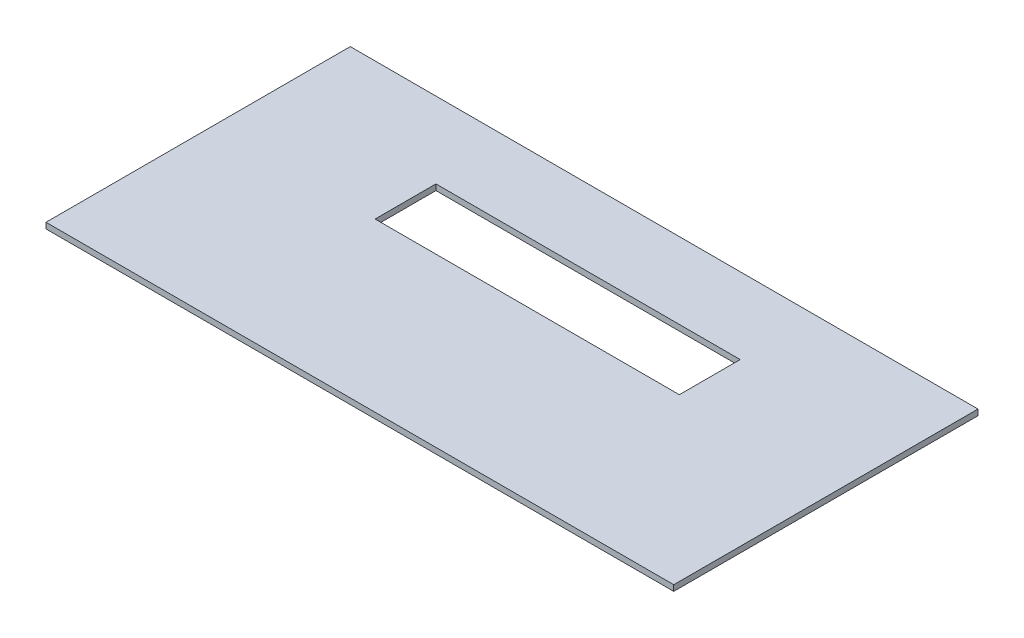
ISO-10303-21;
HEADER;
FILE_DESCRIPTION(('STEP AP214'),'2;1');
FILE_NAME('part.step','',(''),(''),'','','');
FILE_SCHEMA(('AUTOMOTIVE_DESIGN { 1 0 10303 214 1 1 1 1 }'));
ENDSEC;
DATA;
#1=APPLICATION_CONTEXT('core data for automotive mechanical design processes');
#2=APPLICATION_PROTOCOL_DEFINITION('international standard','automotive_design',2000,#1);
#3=PRODUCT_CONTEXT('',#1,'mechanical');
#4=PRODUCT('Part','Part','',(#3));
#5=PRODUCT_RELATED_PRODUCT_CATEGORY('part','',(#4));
#6=PRODUCT_DEFINITION_FORMATION('','',#4);
#7=PRODUCT_DEFINITION_CONTEXT('part definition',#1,'design');
#8=PRODUCT_DEFINITION('design','',#6,#7);
#9=PRODUCT_DEFINITION_SHAPE('','',#8);
#10=(LENGTH_UNIT() NAMED_UNIT(*) SI_UNIT(.MILLI.,.METRE.));
#11=(NAMED_UNIT(*) PLANE_ANGLE_UNIT() SI_UNIT($,.RADIAN.));
#12=(NAMED_UNIT(*) SI_UNIT($,.STERADIAN.) SOLID_ANGLE_UNIT());
#13=UNCERTAINTY_MEASURE_WITH_UNIT(LENGTH_MEASURE(1.E-05),#10,'distance_accuracy_value','');
#14=(GEOMETRIC_REPRESENTATION_CONTEXT(3) GLOBAL_UNCERTAINTY_ASSIGNED_CONTEXT((#13)) GLOBAL_UNIT_ASSIGNED_CONTEXT((#10,
#11,#12)) REPRESENTATION_CONTEXT('',''));
#15=CARTESIAN_POINT('',(0.,0.,0.));
#16=DIRECTION('',(0.,0.,1.));
#17=DIRECTION('',(1.,0.,0.));
#18=AXIS2_PLACEMENT_3D('',#15,#16,#17);
#19=CARTESIAN_POINT('',(65.50787,1.21412,31.75));
#20=DIRECTION('',(-1.,0.,0.));
#21=DIRECTION('',(0.,0.,1.));
#22=AXIS2_PLACEMENT_3D('',#19,#20,#21);
#23=PLANE('',#22);
#24=DIRECTION('',(0.,0.,-1.));
#25=VECTOR('',#24,1.);
#26=CARTESIAN_POINT('',(65.50787,0.,31.75));
#27=LINE('',#26,#25);
#28=CARTESIAN_POINT('',(65.50787,0.,31.75));
#29=VERTEX_POINT('',#28);
#30=CARTESIAN_POINT('',(65.50787,0.,-31.75));
#31=VERTEX_POINT('',#30);
#32=EDGE_CURVE('E151',#29,#31,#27,.T.);
#33=ORIENTED_EDGE('',*,*,#32,.T.);
#34=DIRECTION('',(0.,-1.,0.));
#35=VECTOR('',#34,1.);
#36=CARTESIAN_POINT('',(65.50787,1.21412,-31.75));
#37=LINE('',#36,#35);
#38=CARTESIAN_POINT('',(65.50787,1.21412,-31.75));
#39=VERTEX_POINT('',#38);
#40=EDGE_CURVE('E11',#39,#31,#37,.T.);
#41=ORIENTED_EDGE('',*,*,#40,.F.);
#42=DIRECTION('',(0.,0.,-1.));
#43=VECTOR('',#42,1.);
#44=CARTESIAN_POINT('',(65.50787,1.21412,31.75));
#45=LINE('',#44,#43);
#46=CARTESIAN_POINT('',(65.50787,1.21412,31.75));
#47=VERTEX_POINT('',#46);
#48=EDGE_CURVE('E157',#47,#39,#45,.T.);
#49=ORIENTED_EDGE('',*,*,#48,.F.);
#50=DIRECTION('',(0.,-1.,0.));
#51=VECTOR('',#50,1.);
#52=CARTESIAN_POINT('',(65.50787,1.21412,31.75));
#53=LINE('',#52,#51);
#54=EDGE_CURVE('E171',#47,#29,#53,.T.);
#55=ORIENTED_EDGE('',*,*,#54,.T.);
#56=EDGE_LOOP('',(#33,#41,#49,#55));
#57=FACE_BOUND('',#56,.T.);
#58=ADVANCED_FACE('F43',(#57),#23,.F.);
#59=CARTESIAN_POINT('',(-65.50787,1.21412,-31.75));
#60=DIRECTION('',(0.,0.,1.));
#61=DIRECTION('',(1.,0.,0.));
#62=AXIS2_PLACEMENT_3D('',#59,#60,#61);
#63=PLANE('',#62);
#64=DIRECTION('',(-1.,0.,0.));
#65=VECTOR('',#64,1.);
#66=CARTESIAN_POINT('',(-65.50787,0.,-31.75));
#67=LINE('',#66,#65);
#68=CARTESIAN_POINT('',(-65.50787,0.,-31.75));
#69=VERTEX_POINT('',#68);
#70=EDGE_CURVE('E175',#31,#69,#67,.T.);
#71=ORIENTED_EDGE('',*,*,#70,.T.);
#72=DIRECTION('',(0.,-1.,0.));
#73=VECTOR('',#72,1.);
#74=CARTESIAN_POINT('',(-65.50787,1.21412,-31.75));
#75=LINE('',#74,#73);
#76=CARTESIAN_POINT('',(-65.50787,1.21412,-31.75));
#77=VERTEX_POINT('',#76);
#78=EDGE_CURVE('E51',#77,#69,#75,.T.);
#79=ORIENTED_EDGE('',*,*,#78,.F.);
#80=DIRECTION('',(-1.,0.,0.));
#81=VECTOR('',#80,1.);
#82=CARTESIAN_POINT('',(-65.50787,1.21412,-31.75));
#83=LINE('',#82,#81);
#84=EDGE_CURVE('E161',#39,#77,#83,.T.);
#85=ORIENTED_EDGE('',*,*,#84,.F.);
#86=ORIENTED_EDGE('',*,*,#40,.T.);
#87=EDGE_LOOP('',(#71,#79,#85,#86));
#88=FACE_BOUND('',#87,.T.);
#89=ADVANCED_FACE('F209',(#88),#63,.F.);
#90=CARTESIAN_POINT('',(-65.50787,1.21412,31.75));
#91=DIRECTION('',(1.,0.,0.));
#92=DIRECTION('',(0.,0.,-1.));
#93=AXIS2_PLACEMENT_3D('',#90,#91,#92);
#94=PLANE('',#93);
#95=DIRECTION('',(0.,0.,1.));
#96=VECTOR('',#95,1.);
#97=CARTESIAN_POINT('',(-65.50787,0.,31.75));
#98=LINE('',#97,#96);
#99=CARTESIAN_POINT('',(-65.50787,0.,31.75));
#100=VERTEX_POINT('',#99);
#101=EDGE_CURVE('E178',#69,#100,#98,.T.);
#102=ORIENTED_EDGE('',*,*,#101,.T.);
#103=DIRECTION('',(0.,-1.,0.));
#104=VECTOR('',#103,1.);
#105=CARTESIAN_POINT('',(-65.50787,1.21412,31.75));
#106=LINE('',#105,#104);
#107=CARTESIAN_POINT('',(-65.50787,1.21412,31.75));
#108=VERTEX_POINT('',#107);
#109=EDGE_CURVE('E186',#108,#100,#106,.T.);
#110=ORIENTED_EDGE('',*,*,#109,.F.);
#111=DIRECTION('',(0.,0.,1.));
#112=VECTOR('',#111,1.);
#113=CARTESIAN_POINT('',(-65.50787,1.21412,31.75));
#114=LINE('',#113,#112);
#115=EDGE_CURVE('E165',#77,#108,#114,.T.);
#116=ORIENTED_EDGE('',*,*,#115,.F.);
#117=ORIENTED_EDGE('',*,*,#78,.T.);
#118=EDGE_LOOP('',(#102,#110,#116,#117));
#119=FACE_BOUND('',#118,.T.);
#120=ADVANCED_FACE('F195',(#119),#94,.F.);
#121=CARTESIAN_POINT('',(-65.50787,1.21412,31.75));
#122=DIRECTION('',(0.,0.,-1.));
#123=DIRECTION('',(-1.,0.,0.));
#124=AXIS2_PLACEMENT_3D('',#121,#122,#123);
#125=PLANE('',#124);
#126=DIRECTION('',(1.,0.,0.));
#127=VECTOR('',#126,1.);
#128=CARTESIAN_POINT('',(-65.50787,0.,31.75));
#129=LINE('',#128,#127);
#130=EDGE_CURVE('E162',#100,#29,#129,.T.);
#131=ORIENTED_EDGE('',*,*,#130,.T.);
#132=ORIENTED_EDGE('',*,*,#54,.F.);
#133=DIRECTION('',(1.,0.,0.));
#134=VECTOR('',#133,1.);
#135=CARTESIAN_POINT('',(-65.50787,1.21412,31.75));
#136=LINE('',#135,#134);
#137=EDGE_CURVE('E168',#108,#47,#136,.T.);
#138=ORIENTED_EDGE('',*,*,#137,.F.);
#139=ORIENTED_EDGE('',*,*,#109,.T.);
#140=EDGE_LOOP('',(#131,#132,#138,#139));
#141=FACE_BOUND('',#140,.T.);
#142=ADVANCED_FACE('F202',(#141),#125,.F.);
#143=CARTESIAN_POINT('',(0.,1.21412,0.));
#144=DIRECTION('',(0.,-1.,0.));
#145=DIRECTION('',(0.,0.,-1.));
#146=AXIS2_PLACEMENT_3D('',#143,#144,#145);
#147=PLANE('',#146);
#148=DIRECTION('',(-1.,0.,0.));
#149=VECTOR('',#148,1.);
#150=CARTESIAN_POINT('',(-31.75,1.21412,-15.875));
#151=LINE('',#150,#149);
#152=CARTESIAN_POINT('',(31.75,1.21412,-15.875));
#153=VERTEX_POINT('',#152);
#154=CARTESIAN_POINT('',(-31.75,1.21412,-15.875));
#155=VERTEX_POINT('',#154);
#156=EDGE_CURVE('E142',#153,#155,#151,.T.);
#157=ORIENTED_EDGE('',*,*,#156,.F.);
#158=DIRECTION('',(0.,0.,-1.));
#159=VECTOR('',#158,1.);
#160=CARTESIAN_POINT('',(31.75,1.21412,-3.175));
#161=LINE('',#160,#159);
#162=CARTESIAN_POINT('',(31.75,1.21412,-3.175));
#163=VERTEX_POINT('',#162);
#164=EDGE_CURVE('E58',#163,#153,#161,.T.);
#165=ORIENTED_EDGE('',*,*,#164,.F.);
#166=DIRECTION('',(1.,0.,0.));
#167=VECTOR('',#166,1.);
#168=CARTESIAN_POINT('',(-31.75,1.21412,-3.175));
#169=LINE('',#168,#167);
#170=CARTESIAN_POINT('',(-31.75,1.21412,-3.175));
#171=VERTEX_POINT('',#170);
#172=EDGE_CURVE('E129',#171,#163,#169,.T.);
#173=ORIENTED_EDGE('',*,*,#172,.F.);
#174=DIRECTION('',(0.,0.,1.));
#175=VECTOR('',#174,1.);
#176=CARTESIAN_POINT('',(-31.75,1.21412,-3.175));
#177=LINE('',#176,#175);
#178=EDGE_CURVE('E133',#155,#171,#177,.T.);
#179=ORIENTED_EDGE('',*,*,#178,.F.);
#180=EDGE_LOOP('',(#157,#165,#173,#179));
#181=FACE_BOUND('',#180,.T.);
#182=ORIENTED_EDGE('',*,*,#48,.T.);
#183=ORIENTED_EDGE('',*,*,#84,.T.);
#184=ORIENTED_EDGE('',*,*,#115,.T.);
#185=ORIENTED_EDGE('',*,*,#137,.T.);
#186=EDGE_LOOP('',(#182,#183,#184,#185));
#187=FACE_BOUND('',#186,.T.);
#188=ADVANCED_FACE('F208',(#181,#187),#147,.F.);
#189=CARTESIAN_POINT('',(0.,0.,0.));
#190=DIRECTION('',(0.,-1.,0.));
#191=DIRECTION('',(0.,0.,-1.));
#192=AXIS2_PLACEMENT_3D('',#189,#190,#191);
#193=PLANE('',#192);
#194=DIRECTION('',(0.,0.,-1.));
#195=VECTOR('',#194,1.);
#196=CARTESIAN_POINT('',(31.75,0.,-3.175));
#197=LINE('',#196,#195);
#198=CARTESIAN_POINT('',(31.75,0.,-3.175));
#199=VERTEX_POINT('',#198);
#200=CARTESIAN_POINT('',(31.75,0.,-15.875));
#201=VERTEX_POINT('',#200);
#202=EDGE_CURVE('E110',#199,#201,#197,.T.);
#203=ORIENTED_EDGE('',*,*,#202,.T.);
#204=DIRECTION('',(-1.,0.,0.));
#205=VECTOR('',#204,1.);
#206=CARTESIAN_POINT('',(-31.75,0.,-15.875));
#207=LINE('',#206,#205);
#208=CARTESIAN_POINT('',(-31.75,0.,-15.875));
#209=VERTEX_POINT('',#208);
#210=EDGE_CURVE('E120',#201,#209,#207,.T.);
#211=ORIENTED_EDGE('',*,*,#210,.T.);
#212=DIRECTION('',(0.,0.,1.));
#213=VECTOR('',#212,1.);
#214=CARTESIAN_POINT('',(-31.75,0.,-3.175));
#215=LINE('',#214,#213);
#216=CARTESIAN_POINT('',(-31.75,0.,-3.175));
#217=VERTEX_POINT('',#216);
#218=EDGE_CURVE('E66',#209,#217,#215,.T.);
#219=ORIENTED_EDGE('',*,*,#218,.T.);
#220=DIRECTION('',(1.,0.,0.));
#221=VECTOR('',#220,1.);
#222=CARTESIAN_POINT('',(-31.75,0.,-3.175));
#223=LINE('',#222,#221);
#224=EDGE_CURVE('E117',#217,#199,#223,.T.);
#225=ORIENTED_EDGE('',*,*,#224,.T.);
#226=EDGE_LOOP('',(#203,#211,#219,#225));
#227=FACE_BOUND('',#226,.T.);
#228=ORIENTED_EDGE('',*,*,#32,.F.);
#229=ORIENTED_EDGE('',*,*,#130,.F.);
#230=ORIENTED_EDGE('',*,*,#101,.F.);
#231=ORIENTED_EDGE('',*,*,#70,.F.);
#232=EDGE_LOOP('',(#228,#229,#230,#231));
#233=FACE_BOUND('',#232,.T.);
#234=ADVANCED_FACE('F125',(#227,#233),#193,.T.);
#235=CARTESIAN_POINT('',(31.75,0.,-3.175));
#236=DIRECTION('',(1.,0.,0.));
#237=DIRECTION('',(0.,0.,-1.));
#238=AXIS2_PLACEMENT_3D('',#235,#236,#237);
#239=PLANE('',#238);
#240=ORIENTED_EDGE('',*,*,#164,.T.);
#241=DIRECTION('',(0.,1.,0.));
#242=VECTOR('',#241,1.);
#243=CARTESIAN_POINT('',(31.75,0.,-15.875));
#244=LINE('',#243,#242);
#245=EDGE_CURVE('E106',#201,#153,#244,.T.);
#246=ORIENTED_EDGE('',*,*,#245,.F.);
#247=ORIENTED_EDGE('',*,*,#202,.F.);
#248=DIRECTION('',(0.,1.,0.));
#249=VECTOR('',#248,1.);
#250=CARTESIAN_POINT('',(31.75,0.,-3.175));
#251=LINE('',#250,#249);
#252=EDGE_CURVE('E148',#199,#163,#251,.T.);
#253=ORIENTED_EDGE('',*,*,#252,.T.);
#254=EDGE_LOOP('',(#240,#246,#247,#253));
#255=FACE_BOUND('',#254,.T.);
#256=ADVANCED_FACE('F108',(#255),#239,.F.);
#257=CARTESIAN_POINT('',(-31.75,0.,-3.175));
#258=DIRECTION('',(0.,0.,1.));
#259=DIRECTION('',(1.,0.,0.));
#260=AXIS2_PLACEMENT_3D('',#257,#258,#259);
#261=PLANE('',#260);
#262=ORIENTED_EDGE('',*,*,#172,.T.);
#263=ORIENTED_EDGE('',*,*,#252,.F.);
#264=ORIENTED_EDGE('',*,*,#224,.F.);
#265=DIRECTION('',(0.,1.,0.));
#266=VECTOR('',#265,1.);
#267=CARTESIAN_POINT('',(-31.75,0.,-3.175));
#268=LINE('',#267,#266);
#269=EDGE_CURVE('E152',#217,#171,#268,.T.);
#270=ORIENTED_EDGE('',*,*,#269,.T.);
#271=EDGE_LOOP('',(#262,#263,#264,#270));
#272=FACE_BOUND('',#271,.T.);
#273=ADVANCED_FACE('F226',(#272),#261,.F.);
#274=CARTESIAN_POINT('',(-31.75,0.,-3.175));
#275=DIRECTION('',(-1.,0.,0.));
#276=DIRECTION('',(0.,0.,1.));
#277=AXIS2_PLACEMENT_3D('',#274,#275,#276);
#278=PLANE('',#277);
#279=ORIENTED_EDGE('',*,*,#178,.T.);
#280=ORIENTED_EDGE('',*,*,#269,.F.);
#281=ORIENTED_EDGE('',*,*,#218,.F.);
#282=DIRECTION('',(0.,1.,0.));
#283=VECTOR('',#282,1.);
#284=CARTESIAN_POINT('',(-31.75,0.,-15.875));
#285=LINE('',#284,#283);
#286=EDGE_CURVE('E116',#209,#155,#285,.T.);
#287=ORIENTED_EDGE('',*,*,#286,.T.);
#288=EDGE_LOOP('',(#279,#280,#281,#287));
#289=FACE_BOUND('',#288,.T.);
#290=ADVANCED_FACE('F229',(#289),#278,.F.);
#291=CARTESIAN_POINT('',(-31.75,0.,-15.875));
#292=DIRECTION('',(0.,0.,-1.));
#293=DIRECTION('',(-1.,0.,0.));
#294=AXIS2_PLACEMENT_3D('',#291,#292,#293);
#295=PLANE('',#294);
#296=ORIENTED_EDGE('',*,*,#156,.T.);
#297=ORIENTED_EDGE('',*,*,#286,.F.);
#298=ORIENTED_EDGE('',*,*,#210,.F.);
#299=ORIENTED_EDGE('',*,*,#245,.T.);
#300=EDGE_LOOP('',(#296,#297,#298,#299));
#301=FACE_BOUND('',#300,.T.);
#302=ADVANCED_FACE('F121',(#301),#295,.F.);
#303=CLOSED_SHELL('',(#58,#89,#120,#142,#188,#234,#256,#273,#290,#302));
#304=MANIFOLD_SOLID_BREP('B2',#303);
#305=ADVANCED_BREP_SHAPE_REPRESENTATION('',(#18,#304),#14);
#306=SHAPE_DEFINITION_REPRESENTATION(#9,#305);
ENDSEC;
END-ISO-10303-21;
